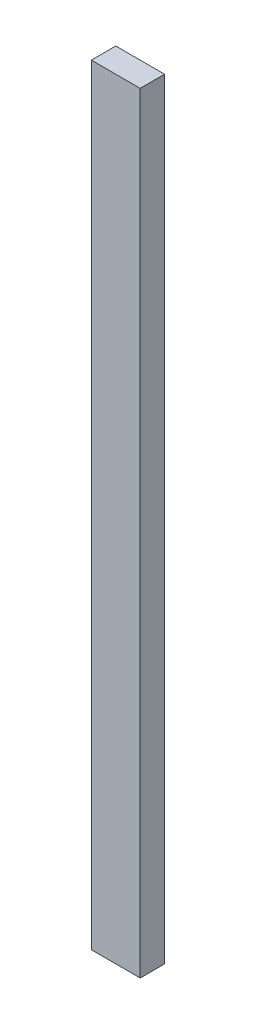
ISO-10303-21;
HEADER;
FILE_DESCRIPTION(('STEP AP214'),'2;1');
FILE_NAME('part.step','',(''),(''),'','','');
FILE_SCHEMA(('AUTOMOTIVE_DESIGN { 1 0 10303 214 1 1 1 1 }'));
ENDSEC;
DATA;
#1=APPLICATION_CONTEXT('core data for automotive mechanical design processes');
#2=APPLICATION_PROTOCOL_DEFINITION('international standard','automotive_design',2000,#1);
#3=PRODUCT_CONTEXT('',#1,'mechanical');
#4=PRODUCT('Part','Part','',(#3));
#5=PRODUCT_RELATED_PRODUCT_CATEGORY('part','',(#4));
#6=PRODUCT_DEFINITION_FORMATION('','',#4);
#7=PRODUCT_DEFINITION_CONTEXT('part definition',#1,'design');
#8=PRODUCT_DEFINITION('design','',#6,#7);
#9=PRODUCT_DEFINITION_SHAPE('','',#8);
#10=(LENGTH_UNIT() NAMED_UNIT(*) SI_UNIT(.MILLI.,.METRE.));
#11=(NAMED_UNIT(*) PLANE_ANGLE_UNIT() SI_UNIT($,.RADIAN.));
#12=(NAMED_UNIT(*) SI_UNIT($,.STERADIAN.) SOLID_ANGLE_UNIT());
#13=UNCERTAINTY_MEASURE_WITH_UNIT(LENGTH_MEASURE(1.E-05),#10,'distance_accuracy_value','');
#14=(GEOMETRIC_REPRESENTATION_CONTEXT(3) GLOBAL_UNCERTAINTY_ASSIGNED_CONTEXT((#13)) GLOBAL_UNIT_ASSIGNED_CONTEXT((#10,
#11,#12)) REPRESENTATION_CONTEXT('',''));
#15=CARTESIAN_POINT('',(0.,0.,0.));
#16=DIRECTION('',(0.,0.,1.));
#17=DIRECTION('',(1.,0.,0.));
#18=AXIS2_PLACEMENT_3D('',#15,#16,#17);
#19=CARTESIAN_POINT('',(6.35,-100.076,6.35));
#20=DIRECTION('',(-1.,0.,0.));
#21=DIRECTION('',(0.,0.,1.));
#22=AXIS2_PLACEMENT_3D('',#19,#20,#21);
#23=PLANE('',#22);
#24=DIRECTION('',(0.,1.,0.));
#25=VECTOR('',#24,1.);
#26=CARTESIAN_POINT('',(6.35,-100.076,0.));
#27=LINE('',#26,#25);
#28=CARTESIAN_POINT('',(6.35,-100.076,0.));
#29=VERTEX_POINT('',#28);
#30=CARTESIAN_POINT('',(6.35,100.076,0.));
#31=VERTEX_POINT('',#30);
#32=EDGE_CURVE('E98',#29,#31,#27,.T.);
#33=ORIENTED_EDGE('',*,*,#32,.T.);
#34=DIRECTION('',(0.,0.,-1.));
#35=VECTOR('',#34,1.);
#36=CARTESIAN_POINT('',(6.35,100.076,6.35));
#37=LINE('',#36,#35);
#38=CARTESIAN_POINT('',(6.35,100.076,6.35));
#39=VERTEX_POINT('',#38);
#40=EDGE_CURVE('E11',#39,#31,#37,.T.);
#41=ORIENTED_EDGE('',*,*,#40,.F.);
#42=DIRECTION('',(0.,1.,0.));
#43=VECTOR('',#42,1.);
#44=CARTESIAN_POINT('',(6.35,-100.076,6.35));
#45=LINE('',#44,#43);
#46=CARTESIAN_POINT('',(6.35,-100.076,6.35));
#47=VERTEX_POINT('',#46);
#48=EDGE_CURVE('E86',#47,#39,#45,.T.);
#49=ORIENTED_EDGE('',*,*,#48,.F.);
#50=DIRECTION('',(0.,0.,-1.));
#51=VECTOR('',#50,1.);
#52=CARTESIAN_POINT('',(6.35,-100.076,6.35));
#53=LINE('',#52,#51);
#54=EDGE_CURVE('E94',#47,#29,#53,.T.);
#55=ORIENTED_EDGE('',*,*,#54,.T.);
#56=EDGE_LOOP('',(#33,#41,#49,#55));
#57=FACE_BOUND('',#56,.T.);
#58=ADVANCED_FACE('F35',(#57),#23,.F.);
#59=CARTESIAN_POINT('',(-6.34999999999999,100.076,6.35));
#60=DIRECTION('',(0.,-1.,0.));
#61=DIRECTION('',(0.,0.,-1.));
#62=AXIS2_PLACEMENT_3D('',#59,#60,#61);
#63=PLANE('',#62);
#64=DIRECTION('',(-1.,0.,0.));
#65=VECTOR('',#64,1.);
#66=CARTESIAN_POINT('',(-6.34999999999999,100.076,0.));
#67=LINE('',#66,#65);
#68=CARTESIAN_POINT('',(-6.34999999999999,100.076,0.));
#69=VERTEX_POINT('',#68);
#70=EDGE_CURVE('E90',#31,#69,#67,.T.);
#71=ORIENTED_EDGE('',*,*,#70,.T.);
#72=DIRECTION('',(0.,0.,-1.));
#73=VECTOR('',#72,1.);
#74=CARTESIAN_POINT('',(-6.34999999999999,100.076,6.35));
#75=LINE('',#74,#73);
#76=CARTESIAN_POINT('',(-6.34999999999999,100.076,6.35));
#77=VERTEX_POINT('',#76);
#78=EDGE_CURVE('E43',#77,#69,#75,.T.);
#79=ORIENTED_EDGE('',*,*,#78,.F.);
#80=DIRECTION('',(-1.,0.,0.));
#81=VECTOR('',#80,1.);
#82=CARTESIAN_POINT('',(-6.34999999999999,100.076,6.35));
#83=LINE('',#82,#81);
#84=EDGE_CURVE('E81',#39,#77,#83,.T.);
#85=ORIENTED_EDGE('',*,*,#84,.F.);
#86=ORIENTED_EDGE('',*,*,#40,.T.);
#87=EDGE_LOOP('',(#71,#79,#85,#86));
#88=FACE_BOUND('',#87,.T.);
#89=ADVANCED_FACE('F89',(#88),#63,.F.);
#90=CARTESIAN_POINT('',(-6.34999999999999,-100.076,6.35));
#91=DIRECTION('',(1.,0.,0.));
#92=DIRECTION('',(0.,0.,-1.));
#93=AXIS2_PLACEMENT_3D('',#90,#91,#92);
#94=PLANE('',#93);
#95=DIRECTION('',(0.,-1.,0.));
#96=VECTOR('',#95,1.);
#97=CARTESIAN_POINT('',(-6.34999999999999,-100.076,0.));
#98=LINE('',#97,#96);
#99=CARTESIAN_POINT('',(-6.34999999999999,-100.076,0.));
#100=VERTEX_POINT('',#99);
#101=EDGE_CURVE('E68',#69,#100,#98,.T.);
#102=ORIENTED_EDGE('',*,*,#101,.T.);
#103=DIRECTION('',(0.,0.,-1.));
#104=VECTOR('',#103,1.);
#105=CARTESIAN_POINT('',(-6.34999999999999,-100.076,6.35));
#106=LINE('',#105,#104);
#107=CARTESIAN_POINT('',(-6.34999999999999,-100.076,6.35));
#108=VERTEX_POINT('',#107);
#109=EDGE_CURVE('E91',#108,#100,#106,.T.);
#110=ORIENTED_EDGE('',*,*,#109,.F.);
#111=DIRECTION('',(0.,-1.,0.));
#112=VECTOR('',#111,1.);
#113=CARTESIAN_POINT('',(-6.34999999999999,-100.076,6.35));
#114=LINE('',#113,#112);
#115=EDGE_CURVE('E84',#77,#108,#114,.T.);
#116=ORIENTED_EDGE('',*,*,#115,.F.);
#117=ORIENTED_EDGE('',*,*,#78,.T.);
#118=EDGE_LOOP('',(#102,#110,#116,#117));
#119=FACE_BOUND('',#118,.T.);
#120=ADVANCED_FACE('F92',(#119),#94,.F.);
#121=CARTESIAN_POINT('',(-6.34999999999999,-100.076,6.35));
#122=DIRECTION('',(0.,1.,0.));
#123=DIRECTION('',(0.,0.,1.));
#124=AXIS2_PLACEMENT_3D('',#121,#122,#123);
#125=PLANE('',#124);
#126=DIRECTION('',(1.,0.,0.));
#127=VECTOR('',#126,1.);
#128=CARTESIAN_POINT('',(-6.34999999999999,-100.076,0.));
#129=LINE('',#128,#127);
#130=EDGE_CURVE('E74',#100,#29,#129,.T.);
#131=ORIENTED_EDGE('',*,*,#130,.T.);
#132=ORIENTED_EDGE('',*,*,#54,.F.);
#133=DIRECTION('',(1.,0.,0.));
#134=VECTOR('',#133,1.);
#135=CARTESIAN_POINT('',(-6.34999999999999,-100.076,6.35));
#136=LINE('',#135,#134);
#137=EDGE_CURVE('E51',#108,#47,#136,.T.);
#138=ORIENTED_EDGE('',*,*,#137,.F.);
#139=ORIENTED_EDGE('',*,*,#109,.T.);
#140=EDGE_LOOP('',(#131,#132,#138,#139));
#141=FACE_BOUND('',#140,.T.);
#142=ADVANCED_FACE('F105',(#141),#125,.F.);
#143=CARTESIAN_POINT('',(0.,0.,6.35));
#144=DIRECTION('',(0.,0.,-1.));
#145=DIRECTION('',(-1.,0.,0.));
#146=AXIS2_PLACEMENT_3D('',#143,#144,#145);
#147=PLANE('',#146);
#148=ORIENTED_EDGE('',*,*,#48,.T.);
#149=ORIENTED_EDGE('',*,*,#84,.T.);
#150=ORIENTED_EDGE('',*,*,#115,.T.);
#151=ORIENTED_EDGE('',*,*,#137,.T.);
#152=EDGE_LOOP('',(#148,#149,#150,#151));
#153=FACE_BOUND('',#152,.T.);
#154=ADVANCED_FACE('F82',(#153),#147,.F.);
#155=CARTESIAN_POINT('',(0.,0.,0.));
#156=DIRECTION('',(0.,0.,-1.));
#157=DIRECTION('',(-1.,0.,0.));
#158=AXIS2_PLACEMENT_3D('',#155,#156,#157);
#159=PLANE('',#158);
#160=ORIENTED_EDGE('',*,*,#32,.F.);
#161=ORIENTED_EDGE('',*,*,#130,.F.);
#162=ORIENTED_EDGE('',*,*,#101,.F.);
#163=ORIENTED_EDGE('',*,*,#70,.F.);
#164=EDGE_LOOP('',(#160,#161,#162,#163));
#165=FACE_BOUND('',#164,.T.);
#166=ADVANCED_FACE('F108',(#165),#159,.T.);
#167=CLOSED_SHELL('',(#58,#89,#120,#142,#154,#166));
#168=MANIFOLD_SOLID_BREP('B2',#167);
#169=ADVANCED_BREP_SHAPE_REPRESENTATION('',(#18,#168),#14);
#170=SHAPE_DEFINITION_REPRESENTATION(#9,#169);
ENDSEC;
END-ISO-10303-21;
